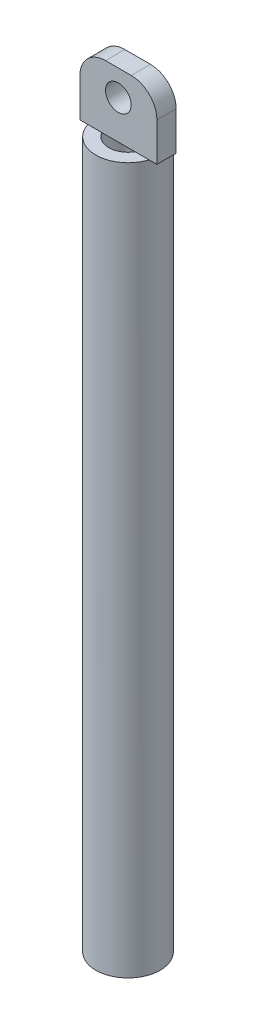
ISO-10303-21;
HEADER;
FILE_DESCRIPTION(('STEP AP214'),'2;1');
FILE_NAME('part.step','',(''),(''),'','','');
FILE_SCHEMA(('AUTOMOTIVE_DESIGN { 1 0 10303 214 1 1 1 1 }'));
ENDSEC;
DATA;
#1=APPLICATION_CONTEXT('core data for automotive mechanical design processes');
#2=APPLICATION_PROTOCOL_DEFINITION('international standard','automotive_design',2000,#1);
#3=PRODUCT_CONTEXT('',#1,'mechanical');
#4=PRODUCT('Part','Part','',(#3));
#5=PRODUCT_RELATED_PRODUCT_CATEGORY('part','',(#4));
#6=PRODUCT_DEFINITION_FORMATION('','',#4);
#7=PRODUCT_DEFINITION_CONTEXT('part definition',#1,'design');
#8=PRODUCT_DEFINITION('design','',#6,#7);
#9=PRODUCT_DEFINITION_SHAPE('','',#8);
#10=(LENGTH_UNIT() NAMED_UNIT(*) SI_UNIT(.MILLI.,.METRE.));
#11=(NAMED_UNIT(*) PLANE_ANGLE_UNIT() SI_UNIT($,.RADIAN.));
#12=(NAMED_UNIT(*) SI_UNIT($,.STERADIAN.) SOLID_ANGLE_UNIT());
#13=UNCERTAINTY_MEASURE_WITH_UNIT(LENGTH_MEASURE(1.E-05),#10,'distance_accuracy_value','');
#14=(GEOMETRIC_REPRESENTATION_CONTEXT(3) GLOBAL_UNCERTAINTY_ASSIGNED_CONTEXT((#13)) GLOBAL_UNIT_ASSIGNED_CONTEXT((#10,
#11,#12)) REPRESENTATION_CONTEXT('',''));
#15=CARTESIAN_POINT('',(0.,0.,0.));
#16=DIRECTION('',(0.,0.,1.));
#17=DIRECTION('',(1.,0.,0.));
#18=AXIS2_PLACEMENT_3D('',#15,#16,#17);
#19=CARTESIAN_POINT('',(0.,55.,0.));
#20=DIRECTION('',(0.,1.,0.));
#21=DIRECTION('',(0.,0.,1.));
#22=AXIS2_PLACEMENT_3D('',#19,#20,#21);
#23=PLANE('',#22);
#24=DIRECTION('',(1.,0.,0.));
#25=VECTOR('',#24,1.);
#26=CARTESIAN_POINT('',(-3.,55.,0.75));
#27=LINE('',#26,#25);
#28=CARTESIAN_POINT('',(-2.38484800354236,55.,0.75));
#29=VERTEX_POINT('',#28);
#30=CARTESIAN_POINT('',(-1.29903810567666,55.,0.75));
#31=VERTEX_POINT('',#30);
#32=EDGE_CURVE('E180',#29,#31,#27,.T.);
#33=ORIENTED_EDGE('',*,*,#32,.F.);
#34=CARTESIAN_POINT('',(0.,55.,0.));
#35=DIRECTION('',(0.,1.,0.));
#36=DIRECTION('',(0.,0.,1.));
#37=AXIS2_PLACEMENT_3D('',#34,#35,#36);
#38=CIRCLE('',#37,2.5);
#39=CARTESIAN_POINT('',(2.38484800354236,55.,0.75));
#40=VERTEX_POINT('',#39);
#41=EDGE_CURVE('E173',#29,#40,#38,.T.);
#42=ORIENTED_EDGE('',*,*,#41,.T.);
#43=CARTESIAN_POINT('',(1.29903810567666,55.,0.75));
#44=VERTEX_POINT('',#43);
#45=EDGE_CURVE('E159',#44,#40,#27,.T.);
#46=ORIENTED_EDGE('',*,*,#45,.F.);
#47=CARTESIAN_POINT('',(0.,55.,0.));
#48=DIRECTION('',(0.,1.,0.));
#49=DIRECTION('',(0.,0.,1.));
#50=AXIS2_PLACEMENT_3D('',#47,#48,#49);
#51=CIRCLE('',#50,1.5);
#52=EDGE_CURVE('E168',#31,#44,#51,.T.);
#53=ORIENTED_EDGE('',*,*,#52,.F.);
#54=EDGE_LOOP('',(#33,#42,#46,#53));
#55=FACE_BOUND('',#54,.T.);
#56=ADVANCED_FACE('F38',(#55),#23,.T.);
#57=DIRECTION('',(-1.,0.,0.));
#58=VECTOR('',#57,1.);
#59=CARTESIAN_POINT('',(-3.,55.,-0.75));
#60=LINE('',#59,#58);
#61=CARTESIAN_POINT('',(2.38484800354236,55.,-0.75));
#62=VERTEX_POINT('',#61);
#63=CARTESIAN_POINT('',(1.29903810567666,55.,-0.75));
#64=VERTEX_POINT('',#63);
#65=EDGE_CURVE('E215',#62,#64,#60,.T.);
#66=ORIENTED_EDGE('',*,*,#65,.F.);
#67=CARTESIAN_POINT('',(-2.38484800354236,55.,-0.75));
#68=VERTEX_POINT('',#67);
#69=EDGE_CURVE('E172',#62,#68,#38,.T.);
#70=ORIENTED_EDGE('',*,*,#69,.T.);
#71=CARTESIAN_POINT('',(-1.29903810567666,55.,-0.75));
#72=VERTEX_POINT('',#71);
#73=EDGE_CURVE('E136',#72,#68,#60,.T.);
#74=ORIENTED_EDGE('',*,*,#73,.F.);
#75=EDGE_CURVE('E167',#64,#72,#51,.T.);
#76=ORIENTED_EDGE('',*,*,#75,.F.);
#77=EDGE_LOOP('',(#66,#70,#74,#76));
#78=FACE_BOUND('',#77,.T.);
#79=ADVANCED_FACE('F234',(#78),#23,.T.);
#80=CARTESIAN_POINT('',(0.,0.,0.));
#81=DIRECTION('',(0.,1.,0.));
#82=DIRECTION('',(0.,0.,1.));
#83=AXIS2_PLACEMENT_3D('',#80,#81,#82);
#84=PLANE('',#83);
#85=CARTESIAN_POINT('',(0.,0.,0.));
#86=DIRECTION('',(0.,1.,0.));
#87=DIRECTION('',(0.,0.,1.));
#88=AXIS2_PLACEMENT_3D('',#85,#86,#87);
#89=CIRCLE('',#88,2.5);
#90=CARTESIAN_POINT('',(0.,0.,2.5));
#91=VERTEX_POINT('',#90);
#92=EDGE_CURVE('E166',#91,#91,#89,.T.);
#93=ORIENTED_EDGE('',*,*,#92,.F.);
#94=EDGE_LOOP('',(#93));
#95=FACE_BOUND('',#94,.T.);
#96=CARTESIAN_POINT('',(0.,0.,0.));
#97=DIRECTION('',(0.,1.,0.));
#98=DIRECTION('',(0.,0.,1.));
#99=AXIS2_PLACEMENT_3D('',#96,#97,#98);
#100=CIRCLE('',#99,1.5);
#101=CARTESIAN_POINT('',(0.,0.,1.5));
#102=VERTEX_POINT('',#101);
#103=EDGE_CURVE('E121',#102,#102,#100,.T.);
#104=ORIENTED_EDGE('',*,*,#103,.T.);
#105=EDGE_LOOP('',(#104));
#106=FACE_BOUND('',#105,.T.);
#107=ADVANCED_FACE('F239',(#95,#106),#84,.F.);
#108=CARTESIAN_POINT('',(0.,55.,0.));
#109=DIRECTION('',(0.,-1.,0.));
#110=DIRECTION('',(0.,0.,-1.));
#111=AXIS2_PLACEMENT_3D('',#108,#109,#110);
#112=CYLINDRICAL_SURFACE('',#111,2.5);
#113=EDGE_CURVE('E131',#40,#62,#38,.T.);
#114=ORIENTED_EDGE('',*,*,#113,.F.);
#115=ORIENTED_EDGE('',*,*,#41,.F.);
#116=EDGE_CURVE('E208',#68,#29,#38,.T.);
#117=ORIENTED_EDGE('',*,*,#116,.F.);
#118=ORIENTED_EDGE('',*,*,#69,.F.);
#119=EDGE_LOOP('',(#114,#115,#117,#118));
#120=FACE_BOUND('',#119,.T.);
#121=ORIENTED_EDGE('',*,*,#92,.T.);
#122=EDGE_LOOP('',(#121));
#123=FACE_BOUND('',#122,.T.);
#124=ADVANCED_FACE('F236',(#120,#123),#112,.T.);
#125=CARTESIAN_POINT('',(0.,55.,0.));
#126=DIRECTION('',(0.,-1.,0.));
#127=DIRECTION('',(0.,0.,-1.));
#128=AXIS2_PLACEMENT_3D('',#125,#126,#127);
#129=CYLINDRICAL_SURFACE('',#128,1.5);
#130=EDGE_CURVE('E164',#44,#64,#51,.T.);
#131=ORIENTED_EDGE('',*,*,#130,.T.);
#132=ORIENTED_EDGE('',*,*,#75,.T.);
#133=EDGE_CURVE('E226',#72,#31,#51,.T.);
#134=ORIENTED_EDGE('',*,*,#133,.T.);
#135=ORIENTED_EDGE('',*,*,#52,.T.);
#136=EDGE_LOOP('',(#131,#132,#134,#135));
#137=FACE_BOUND('',#136,.T.);
#138=ORIENTED_EDGE('',*,*,#103,.F.);
#139=EDGE_LOOP('',(#138));
#140=FACE_BOUND('',#139,.T.);
#141=ADVANCED_FACE('F221',(#137,#140),#129,.F.);
#142=CARTESIAN_POINT('',(0.,55.,0.));
#143=DIRECTION('',(0.,1.,0.));
#144=DIRECTION('',(0.,0.,1.));
#145=AXIS2_PLACEMENT_3D('',#142,#143,#144);
#146=PLANE('',#145);
#147=CARTESIAN_POINT('',(3.,55.,0.75));
#148=VERTEX_POINT('',#147);
#149=EDGE_CURVE('E153',#40,#148,#27,.T.);
#150=ORIENTED_EDGE('',*,*,#149,.F.);
#151=ORIENTED_EDGE('',*,*,#113,.T.);
#152=CARTESIAN_POINT('',(3.,55.,-0.75));
#153=VERTEX_POINT('',#152);
#154=EDGE_CURVE('E117',#153,#62,#60,.T.);
#155=ORIENTED_EDGE('',*,*,#154,.F.);
#156=DIRECTION('',(0.,0.,-1.));
#157=VECTOR('',#156,1.);
#158=CARTESIAN_POINT('',(3.,55.,-0.75));
#159=LINE('',#158,#157);
#160=EDGE_CURVE('E129',#148,#153,#159,.T.);
#161=ORIENTED_EDGE('',*,*,#160,.F.);
#162=EDGE_LOOP('',(#150,#151,#155,#161));
#163=FACE_BOUND('',#162,.T.);
#164=ADVANCED_FACE('F128',(#163),#146,.F.);
#165=CARTESIAN_POINT('',(-3.,55.,-0.75));
#166=VERTEX_POINT('',#165);
#167=EDGE_CURVE('E135',#68,#166,#60,.T.);
#168=ORIENTED_EDGE('',*,*,#167,.F.);
#169=ORIENTED_EDGE('',*,*,#116,.T.);
#170=CARTESIAN_POINT('',(-3.,55.,0.75));
#171=VERTEX_POINT('',#170);
#172=EDGE_CURVE('E154',#171,#29,#27,.T.);
#173=ORIENTED_EDGE('',*,*,#172,.F.);
#174=DIRECTION('',(0.,0.,1.));
#175=VECTOR('',#174,1.);
#176=CARTESIAN_POINT('',(-3.,55.,-0.75));
#177=LINE('',#176,#175);
#178=EDGE_CURVE('E132',#166,#171,#177,.T.);
#179=ORIENTED_EDGE('',*,*,#178,.F.);
#180=EDGE_LOOP('',(#168,#169,#173,#179));
#181=FACE_BOUND('',#180,.T.);
#182=ADVANCED_FACE('F206',(#181),#146,.F.);
#183=CARTESIAN_POINT('',(3.,60.,-0.75));
#184=DIRECTION('',(-1.,0.,0.));
#185=DIRECTION('',(0.,0.,1.));
#186=AXIS2_PLACEMENT_3D('',#183,#184,#185);
#187=PLANE('',#186);
#188=DIRECTION('',(0.,-1.,0.));
#189=VECTOR('',#188,1.);
#190=CARTESIAN_POINT('',(3.,60.,-0.75));
#191=LINE('',#190,#189);
#192=CARTESIAN_POINT('',(3.,58.,-0.75));
#193=VERTEX_POINT('',#192);
#194=EDGE_CURVE('E113',#193,#153,#191,.T.);
#195=ORIENTED_EDGE('',*,*,#194,.F.);
#196=DIRECTION('',(0.,0.,-1.));
#197=VECTOR('',#196,1.);
#198=CARTESIAN_POINT('',(3.,58.,0.75));
#199=LINE('',#198,#197);
#200=CARTESIAN_POINT('',(3.,58.,0.75));
#201=VERTEX_POINT('',#200);
#202=EDGE_CURVE('E11',#193,#201,#199,.F.);
#203=ORIENTED_EDGE('',*,*,#202,.T.);
#204=DIRECTION('',(0.,-1.,0.));
#205=VECTOR('',#204,1.);
#206=CARTESIAN_POINT('',(3.,60.,0.75));
#207=LINE('',#206,#205);
#208=EDGE_CURVE('E139',#201,#148,#207,.T.);
#209=ORIENTED_EDGE('',*,*,#208,.T.);
#210=ORIENTED_EDGE('',*,*,#160,.T.);
#211=EDGE_LOOP('',(#195,#203,#209,#210));
#212=FACE_BOUND('',#211,.T.);
#213=ADVANCED_FACE('F137',(#212),#187,.F.);
#214=CARTESIAN_POINT('',(-3.,60.,-0.75));
#215=DIRECTION('',(0.,0.,1.));
#216=DIRECTION('',(1.,0.,0.));
#217=AXIS2_PLACEMENT_3D('',#214,#215,#216);
#218=PLANE('',#217);
#219=CARTESIAN_POINT('',(0.,58.,-0.75));
#220=DIRECTION('',(0.,0.,-1.));
#221=DIRECTION('',(-1.,0.,0.));
#222=AXIS2_PLACEMENT_3D('',#219,#220,#221);
#223=CIRCLE('',#222,1.);
#224=CARTESIAN_POINT('',(-1.,58.,-0.75));
#225=VERTEX_POINT('',#224);
#226=EDGE_CURVE('E145',#225,#225,#223,.T.);
#227=ORIENTED_EDGE('',*,*,#226,.F.);
#228=EDGE_LOOP('',(#227));
#229=FACE_BOUND('',#228,.T.);
#230=DIRECTION('',(0.,-1.,0.));
#231=VECTOR('',#230,1.);
#232=CARTESIAN_POINT('',(-3.,60.,-0.75));
#233=LINE('',#232,#231);
#234=CARTESIAN_POINT('',(-3.,58.,-0.75));
#235=VERTEX_POINT('',#234);
#236=EDGE_CURVE('E122',#235,#166,#233,.T.);
#237=ORIENTED_EDGE('',*,*,#236,.F.);
#238=CARTESIAN_POINT('',(-1.,58.,-0.75));
#239=DIRECTION('',(0.,0.,1.));
#240=DIRECTION('',(1.,0.,0.));
#241=AXIS2_PLACEMENT_3D('',#238,#239,#240);
#242=CIRCLE('',#241,2.);
#243=CARTESIAN_POINT('',(-1.,60.,-0.75));
#244=VERTEX_POINT('',#243);
#245=EDGE_CURVE('E46',#235,#244,#242,.F.);
#246=ORIENTED_EDGE('',*,*,#245,.T.);
#247=DIRECTION('',(-1.,0.,0.));
#248=VECTOR('',#247,1.);
#249=CARTESIAN_POINT('',(-3.,60.,-0.75));
#250=LINE('',#249,#248);
#251=CARTESIAN_POINT('',(1.,60.,-0.75));
#252=VERTEX_POINT('',#251);
#253=EDGE_CURVE('E157',#252,#244,#250,.T.);
#254=ORIENTED_EDGE('',*,*,#253,.F.);
#255=CARTESIAN_POINT('',(1.,58.,-0.75));
#256=DIRECTION('',(0.,0.,1.));
#257=DIRECTION('',(1.,0.,0.));
#258=AXIS2_PLACEMENT_3D('',#255,#256,#257);
#259=CIRCLE('',#258,2.);
#260=EDGE_CURVE('E53',#252,#193,#259,.F.);
#261=ORIENTED_EDGE('',*,*,#260,.T.);
#262=ORIENTED_EDGE('',*,*,#194,.T.);
#263=ORIENTED_EDGE('',*,*,#154,.T.);
#264=ORIENTED_EDGE('',*,*,#65,.T.);
#265=EDGE_CURVE('E133',#64,#72,#60,.T.);
#266=ORIENTED_EDGE('',*,*,#265,.T.);
#267=ORIENTED_EDGE('',*,*,#73,.T.);
#268=ORIENTED_EDGE('',*,*,#167,.T.);
#269=EDGE_LOOP('',(#237,#246,#254,#261,#262,#263,#264,#266,#267,#268));
#270=FACE_BOUND('',#269,.T.);
#271=ADVANCED_FACE('F115',(#229,#270),#218,.F.);
#272=CARTESIAN_POINT('',(-3.,60.,-0.75));
#273=DIRECTION('',(1.,0.,0.));
#274=DIRECTION('',(0.,0.,-1.));
#275=AXIS2_PLACEMENT_3D('',#272,#273,#274);
#276=PLANE('',#275);
#277=DIRECTION('',(0.,-1.,0.));
#278=VECTOR('',#277,1.);
#279=CARTESIAN_POINT('',(-3.,60.,0.75));
#280=LINE('',#279,#278);
#281=CARTESIAN_POINT('',(-3.,58.,0.75));
#282=VERTEX_POINT('',#281);
#283=EDGE_CURVE('E161',#282,#171,#280,.T.);
#284=ORIENTED_EDGE('',*,*,#283,.F.);
#285=DIRECTION('',(0.,0.,1.));
#286=VECTOR('',#285,1.);
#287=CARTESIAN_POINT('',(-3.,58.,-0.75));
#288=LINE('',#287,#286);
#289=EDGE_CURVE('E61',#282,#235,#288,.F.);
#290=ORIENTED_EDGE('',*,*,#289,.T.);
#291=ORIENTED_EDGE('',*,*,#236,.T.);
#292=ORIENTED_EDGE('',*,*,#178,.T.);
#293=EDGE_LOOP('',(#284,#290,#291,#292));
#294=FACE_BOUND('',#293,.T.);
#295=ADVANCED_FACE('F200',(#294),#276,.F.);
#296=CARTESIAN_POINT('',(-3.,60.,0.75));
#297=DIRECTION('',(0.,0.,-1.));
#298=DIRECTION('',(-1.,0.,0.));
#299=AXIS2_PLACEMENT_3D('',#296,#297,#298);
#300=PLANE('',#299);
#301=CARTESIAN_POINT('',(0.,58.,0.75));
#302=DIRECTION('',(0.,0.,-1.));
#303=DIRECTION('',(-1.,0.,0.));
#304=AXIS2_PLACEMENT_3D('',#301,#302,#303);
#305=CIRCLE('',#304,1.);
#306=CARTESIAN_POINT('',(-1.,58.,0.75));
#307=VERTEX_POINT('',#306);
#308=EDGE_CURVE('E141',#307,#307,#305,.T.);
#309=ORIENTED_EDGE('',*,*,#308,.T.);
#310=EDGE_LOOP('',(#309));
#311=FACE_BOUND('',#310,.T.);
#312=DIRECTION('',(1.,0.,0.));
#313=VECTOR('',#312,1.);
#314=CARTESIAN_POINT('',(-3.,60.,0.75));
#315=LINE('',#314,#313);
#316=CARTESIAN_POINT('',(-1.,60.,0.75));
#317=VERTEX_POINT('',#316);
#318=CARTESIAN_POINT('',(1.,60.,0.75));
#319=VERTEX_POINT('',#318);
#320=EDGE_CURVE('E148',#317,#319,#315,.T.);
#321=ORIENTED_EDGE('',*,*,#320,.F.);
#322=CARTESIAN_POINT('',(-1.,58.,0.75));
#323=DIRECTION('',(0.,0.,-1.));
#324=DIRECTION('',(-1.,0.,0.));
#325=AXIS2_PLACEMENT_3D('',#322,#323,#324);
#326=CIRCLE('',#325,2.);
#327=EDGE_CURVE('E185',#317,#282,#326,.F.);
#328=ORIENTED_EDGE('',*,*,#327,.T.);
#329=ORIENTED_EDGE('',*,*,#283,.T.);
#330=ORIENTED_EDGE('',*,*,#172,.T.);
#331=ORIENTED_EDGE('',*,*,#32,.T.);
#332=EDGE_CURVE('E158',#31,#44,#27,.T.);
#333=ORIENTED_EDGE('',*,*,#332,.T.);
#334=ORIENTED_EDGE('',*,*,#45,.T.);
#335=ORIENTED_EDGE('',*,*,#149,.T.);
#336=ORIENTED_EDGE('',*,*,#208,.F.);
#337=CARTESIAN_POINT('',(1.,58.,0.75));
#338=DIRECTION('',(0.,0.,-1.));
#339=DIRECTION('',(-1.,0.,0.));
#340=AXIS2_PLACEMENT_3D('',#337,#338,#339);
#341=CIRCLE('',#340,2.);
#342=EDGE_CURVE('E183',#201,#319,#341,.F.);
#343=ORIENTED_EDGE('',*,*,#342,.T.);
#344=EDGE_LOOP('',(#321,#328,#329,#330,#331,#333,#334,#335,#336,#343));
#345=FACE_BOUND('',#344,.T.);
#346=ADVANCED_FACE('F199',(#311,#345),#300,.F.);
#347=CARTESIAN_POINT('',(0.,60.,0.));
#348=DIRECTION('',(0.,1.,0.));
#349=DIRECTION('',(0.,0.,1.));
#350=AXIS2_PLACEMENT_3D('',#347,#348,#349);
#351=PLANE('',#350);
#352=ORIENTED_EDGE('',*,*,#253,.T.);
#353=DIRECTION('',(0.,0.,1.));
#354=VECTOR('',#353,1.);
#355=CARTESIAN_POINT('',(-1.,60.,0.75));
#356=LINE('',#355,#354);
#357=EDGE_CURVE('E179',#244,#317,#356,.T.);
#358=ORIENTED_EDGE('',*,*,#357,.T.);
#359=ORIENTED_EDGE('',*,*,#320,.T.);
#360=DIRECTION('',(0.,0.,-1.));
#361=VECTOR('',#360,1.);
#362=CARTESIAN_POINT('',(1.,60.,-0.75));
#363=LINE('',#362,#361);
#364=EDGE_CURVE('E176',#319,#252,#363,.T.);
#365=ORIENTED_EDGE('',*,*,#364,.T.);
#366=EDGE_LOOP('',(#352,#358,#359,#365));
#367=FACE_BOUND('',#366,.T.);
#368=ADVANCED_FACE('F193',(#367),#351,.T.);
#369=ORIENTED_EDGE('',*,*,#130,.F.);
#370=ORIENTED_EDGE('',*,*,#332,.F.);
#371=ORIENTED_EDGE('',*,*,#133,.F.);
#372=ORIENTED_EDGE('',*,*,#265,.F.);
#373=EDGE_LOOP('',(#369,#370,#371,#372));
#374=FACE_BOUND('',#373,.T.);
#375=ADVANCED_FACE('F229',(#374),#146,.F.);
#376=CARTESIAN_POINT('',(0.,58.,2.5));
#377=DIRECTION('',(0.,0.,-1.));
#378=DIRECTION('',(-1.,0.,0.));
#379=AXIS2_PLACEMENT_3D('',#376,#377,#378);
#380=CYLINDRICAL_SURFACE('',#379,1.);
#381=ORIENTED_EDGE('',*,*,#226,.T.);
#382=EDGE_LOOP('',(#381));
#383=FACE_BOUND('',#382,.T.);
#384=ORIENTED_EDGE('',*,*,#308,.F.);
#385=EDGE_LOOP('',(#384));
#386=FACE_BOUND('',#385,.T.);
#387=ADVANCED_FACE('F260',(#383,#386),#380,.F.);
#388=CARTESIAN_POINT('',(-1.,58.,0.));
#389=DIRECTION('',(0.,0.,-1.));
#390=DIRECTION('',(-1.,0.,0.));
#391=AXIS2_PLACEMENT_3D('',#388,#389,#390);
#392=CYLINDRICAL_SURFACE('',#391,2.);
#393=ORIENTED_EDGE('',*,*,#245,.F.);
#394=ORIENTED_EDGE('',*,*,#289,.F.);
#395=ORIENTED_EDGE('',*,*,#327,.F.);
#396=ORIENTED_EDGE('',*,*,#357,.F.);
#397=EDGE_LOOP('',(#393,#394,#395,#396));
#398=FACE_BOUND('',#397,.T.);
#399=ADVANCED_FACE('F197',(#398),#392,.T.);
#400=CARTESIAN_POINT('',(1.,58.,0.));
#401=DIRECTION('',(0.,0.,1.));
#402=DIRECTION('',(1.,0.,0.));
#403=AXIS2_PLACEMENT_3D('',#400,#401,#402);
#404=CYLINDRICAL_SURFACE('',#403,2.);
#405=ORIENTED_EDGE('',*,*,#342,.F.);
#406=ORIENTED_EDGE('',*,*,#202,.F.);
#407=ORIENTED_EDGE('',*,*,#260,.F.);
#408=ORIENTED_EDGE('',*,*,#364,.F.);
#409=EDGE_LOOP('',(#405,#406,#407,#408));
#410=FACE_BOUND('',#409,.T.);
#411=ADVANCED_FACE('F40',(#410),#404,.T.);
#412=CLOSED_SHELL('',(#56,#79,#107,#124,#141,#164,#182,#213,#271,#295,#346,#368,#375,#387,#399,#411));
#413=MANIFOLD_SOLID_BREP('B2',#412);
#414=ADVANCED_BREP_SHAPE_REPRESENTATION('',(#18,#413),#14);
#415=SHAPE_DEFINITION_REPRESENTATION(#9,#414);
ENDSEC;
END-ISO-10303-21;
